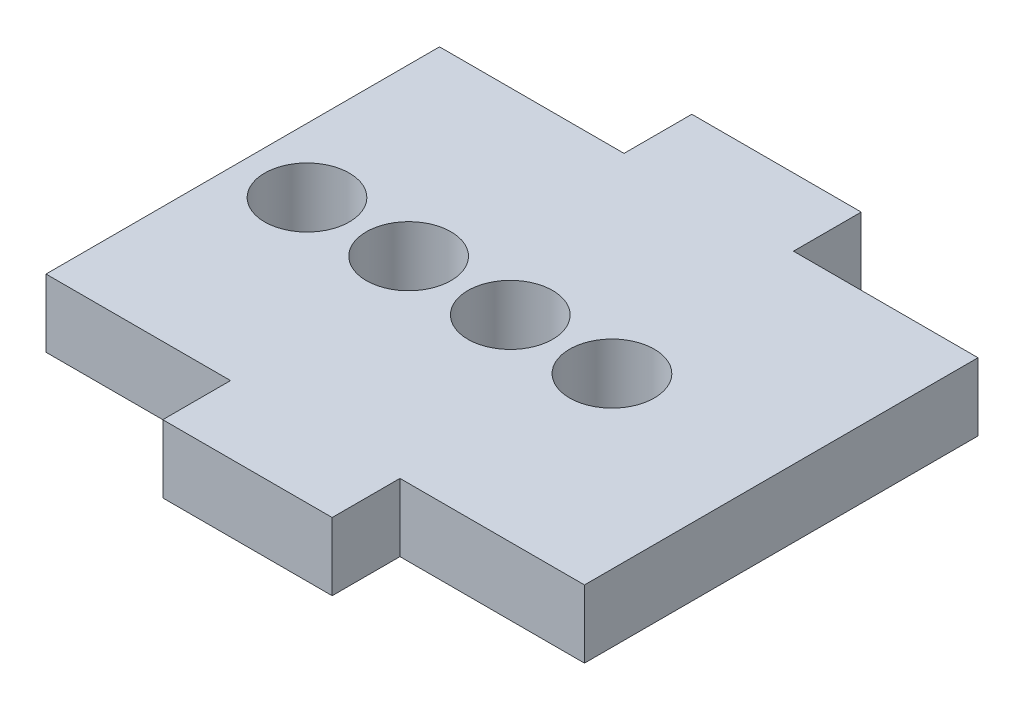
ISO-10303-21;
HEADER;
FILE_DESCRIPTION(('STEP AP214'),'2;1');
FILE_NAME('part.step','',(''),(''),'','','');
FILE_SCHEMA(('AUTOMOTIVE_DESIGN { 1 0 10303 214 1 1 1 1 }'));
ENDSEC;
DATA;
#1=APPLICATION_CONTEXT('core data for automotive mechanical design processes');
#2=APPLICATION_PROTOCOL_DEFINITION('international standard','automotive_design',2000,#1);
#3=PRODUCT_CONTEXT('',#1,'mechanical');
#4=PRODUCT('Part','Part','',(#3));
#5=PRODUCT_RELATED_PRODUCT_CATEGORY('part','',(#4));
#6=PRODUCT_DEFINITION_FORMATION('','',#4);
#7=PRODUCT_DEFINITION_CONTEXT('part definition',#1,'design');
#8=PRODUCT_DEFINITION('design','',#6,#7);
#9=PRODUCT_DEFINITION_SHAPE('','',#8);
#10=(LENGTH_UNIT() NAMED_UNIT(*) SI_UNIT(.MILLI.,.METRE.));
#11=(NAMED_UNIT(*) PLANE_ANGLE_UNIT() SI_UNIT($,.RADIAN.));
#12=(NAMED_UNIT(*) SI_UNIT($,.STERADIAN.) SOLID_ANGLE_UNIT());
#13=UNCERTAINTY_MEASURE_WITH_UNIT(LENGTH_MEASURE(1.E-05),#10,'distance_accuracy_value','');
#14=(GEOMETRIC_REPRESENTATION_CONTEXT(3) GLOBAL_UNCERTAINTY_ASSIGNED_CONTEXT((#13)) GLOBAL_UNIT_ASSIGNED_CONTEXT((#10,
#11,#12)) REPRESENTATION_CONTEXT('',''));
#15=CARTESIAN_POINT('',(0.,0.,0.));
#16=DIRECTION('',(0.,0.,1.));
#17=DIRECTION('',(1.,0.,0.));
#18=AXIS2_PLACEMENT_3D('',#15,#16,#17);
#19=CARTESIAN_POINT('',(27.518556454203,4.,-11.6138310832215));
#20=DIRECTION('',(0.,0.,1.));
#21=DIRECTION('',(1.,0.,0.));
#22=AXIS2_PLACEMENT_3D('',#19,#20,#21);
#23=PLANE('',#22);
#24=DIRECTION('',(0.,1.,0.));
#25=VECTOR('',#24,1.);
#26=CARTESIAN_POINT('',(23.600343903753,0.,-11.6138310832215));
#27=LINE('',#26,#25);
#28=CARTESIAN_POINT('',(23.600343903753,0.,-11.6138310832215));
#29=VERTEX_POINT('',#28);
#30=CARTESIAN_POINT('',(23.600343903753,4.,-11.6138310832215));
#31=VERTEX_POINT('',#30);
#32=EDGE_CURVE('E58',#29,#31,#27,.T.);
#33=ORIENTED_EDGE('',*,*,#32,.F.);
#34=DIRECTION('',(-1.,0.,0.));
#35=VECTOR('',#34,1.);
#36=CARTESIAN_POINT('',(27.518556454203,0.,-11.6138310832215));
#37=LINE('',#36,#35);
#38=CARTESIAN_POINT('',(12.7081857398498,0.,-11.6138310832215));
#39=VERTEX_POINT('',#38);
#40=EDGE_CURVE('E227',#29,#39,#37,.T.);
#41=ORIENTED_EDGE('',*,*,#40,.T.);
#42=DIRECTION('',(0.,-1.,0.));
#43=VECTOR('',#42,1.);
#44=CARTESIAN_POINT('',(12.7081857398498,4.,-11.6138310832215));
#45=LINE('',#44,#43);
#46=CARTESIAN_POINT('',(12.7081857398498,4.,-11.6138310832215));
#47=VERTEX_POINT('',#46);
#48=EDGE_CURVE('E43',#47,#39,#45,.T.);
#49=ORIENTED_EDGE('',*,*,#48,.F.);
#50=DIRECTION('',(-1.,0.,0.));
#51=VECTOR('',#50,1.);
#52=CARTESIAN_POINT('',(36.7868777555258,4.,-11.6138310832215));
#53=LINE('',#52,#51);
#54=EDGE_CURVE('E214',#31,#47,#53,.T.);
#55=ORIENTED_EDGE('',*,*,#54,.F.);
#56=EDGE_LOOP('',(#33,#41,#49,#55));
#57=FACE_BOUND('',#56,.T.);
#58=ADVANCED_FACE('F35',(#57),#23,.F.);
#59=CARTESIAN_POINT('',(36.7868777555258,4.,11.6138310832215));
#60=DIRECTION('',(0.,0.,-1.));
#61=DIRECTION('',(-1.,0.,0.));
#62=AXIS2_PLACEMENT_3D('',#59,#60,#61);
#63=PLANE('',#62);
#64=DIRECTION('',(0.,1.,0.));
#65=VECTOR('',#64,1.);
#66=CARTESIAN_POINT('',(33.600343903753,0.,11.6138310832215));
#67=LINE('',#66,#65);
#68=CARTESIAN_POINT('',(33.600343903753,0.,11.6138310832215));
#69=VERTEX_POINT('',#68);
#70=CARTESIAN_POINT('',(33.600343903753,4.,11.6138310832215));
#71=VERTEX_POINT('',#70);
#72=EDGE_CURVE('E155',#69,#71,#67,.T.);
#73=ORIENTED_EDGE('',*,*,#72,.F.);
#74=DIRECTION('',(1.,0.,0.));
#75=VECTOR('',#74,1.);
#76=CARTESIAN_POINT('',(36.7868777555258,0.,11.6138310832215));
#77=LINE('',#76,#75);
#78=CARTESIAN_POINT('',(44.4925020676562,0.,11.6138310832215));
#79=VERTEX_POINT('',#78);
#80=EDGE_CURVE('E233',#69,#79,#77,.T.);
#81=ORIENTED_EDGE('',*,*,#80,.T.);
#82=DIRECTION('',(0.,-1.,0.));
#83=VECTOR('',#82,1.);
#84=CARTESIAN_POINT('',(44.4925020676562,4.,11.6138310832215));
#85=LINE('',#84,#83);
#86=CARTESIAN_POINT('',(44.4925020676562,4.,11.6138310832215));
#87=VERTEX_POINT('',#86);
#88=EDGE_CURVE('E224',#87,#79,#85,.T.);
#89=ORIENTED_EDGE('',*,*,#88,.F.);
#90=DIRECTION('',(1.,0.,0.));
#91=VECTOR('',#90,1.);
#92=CARTESIAN_POINT('',(27.518556454203,4.,11.6138310832215));
#93=LINE('',#92,#91);
#94=EDGE_CURVE('E220',#71,#87,#93,.T.);
#95=ORIENTED_EDGE('',*,*,#94,.F.);
#96=EDGE_LOOP('',(#73,#81,#89,#95));
#97=FACE_BOUND('',#96,.T.);
#98=ADVANCED_FACE('F285',(#97),#63,.F.);
#99=DIRECTION('',(0.,-1.,0.));
#100=VECTOR('',#99,1.);
#101=CARTESIAN_POINT('',(23.600343903753,0.,11.6138310832215));
#102=LINE('',#101,#100);
#103=CARTESIAN_POINT('',(23.600343903753,4.,11.6138310832215));
#104=VERTEX_POINT('',#103);
#105=CARTESIAN_POINT('',(23.600343903753,0.,11.6138310832215));
#106=VERTEX_POINT('',#105);
#107=EDGE_CURVE('E164',#104,#106,#102,.T.);
#108=ORIENTED_EDGE('',*,*,#107,.F.);
#109=CARTESIAN_POINT('',(12.7081857398498,4.,11.6138310832215));
#110=VERTEX_POINT('',#109);
#111=EDGE_CURVE('E221',#110,#104,#93,.T.);
#112=ORIENTED_EDGE('',*,*,#111,.F.);
#113=DIRECTION('',(0.,-1.,0.));
#114=VECTOR('',#113,1.);
#115=CARTESIAN_POINT('',(12.7081857398498,4.,11.6138310832215));
#116=LINE('',#115,#114);
#117=CARTESIAN_POINT('',(12.7081857398498,0.,11.6138310832215));
#118=VERTEX_POINT('',#117);
#119=EDGE_CURVE('E237',#110,#118,#116,.T.);
#120=ORIENTED_EDGE('',*,*,#119,.T.);
#121=EDGE_CURVE('E215',#118,#106,#77,.T.);
#122=ORIENTED_EDGE('',*,*,#121,.T.);
#123=EDGE_LOOP('',(#108,#112,#120,#122));
#124=FACE_BOUND('',#123,.T.);
#125=ADVANCED_FACE('F249',(#124),#63,.F.);
#126=CARTESIAN_POINT('',(0.,4.,0.));
#127=DIRECTION('',(0.,1.,0.));
#128=DIRECTION('',(0.,0.,1.));
#129=AXIS2_PLACEMENT_3D('',#126,#127,#128);
#130=PLANE('',#129);
#131=CARTESIAN_POINT('',(28.5,4.,0.));
#132=DIRECTION('',(0.,1.,0.));
#133=DIRECTION('',(0.,0.,1.));
#134=AXIS2_PLACEMENT_3D('',#131,#132,#133);
#135=CIRCLE('',#134,2.5);
#136=CARTESIAN_POINT('',(28.5,4.,2.5));
#137=VERTEX_POINT('',#136);
#138=EDGE_CURVE('E193',#137,#137,#135,.T.);
#139=ORIENTED_EDGE('',*,*,#138,.F.);
#140=EDGE_LOOP('',(#139));
#141=FACE_BOUND('',#140,.T.);
#142=CARTESIAN_POINT('',(16.5,4.,0.));
#143=DIRECTION('',(0.,1.,0.));
#144=DIRECTION('',(0.,0.,1.));
#145=AXIS2_PLACEMENT_3D('',#142,#143,#144);
#146=CIRCLE('',#145,2.5);
#147=CARTESIAN_POINT('',(16.5,4.,2.5));
#148=VERTEX_POINT('',#147);
#149=EDGE_CURVE('E205',#148,#148,#146,.T.);
#150=ORIENTED_EDGE('',*,*,#149,.F.);
#151=EDGE_LOOP('',(#150));
#152=FACE_BOUND('',#151,.T.);
#153=DIRECTION('',(0.,0.,-1.));
#154=VECTOR('',#153,1.);
#155=CARTESIAN_POINT('',(44.4925020676562,4.,-11.6138310832215));
#156=LINE('',#155,#154);
#157=CARTESIAN_POINT('',(44.4925020676562,4.,-11.6138310832215));
#158=VERTEX_POINT('',#157);
#159=EDGE_CURVE('E211',#87,#158,#156,.T.);
#160=ORIENTED_EDGE('',*,*,#159,.T.);
#161=CARTESIAN_POINT('',(33.600343903753,4.,-11.6138310832215));
#162=VERTEX_POINT('',#161);
#163=EDGE_CURVE('E216',#158,#162,#53,.T.);
#164=ORIENTED_EDGE('',*,*,#163,.T.);
#165=DIRECTION('',(0.,0.,1.));
#166=VECTOR('',#165,1.);
#167=CARTESIAN_POINT('',(33.600343903753,4.,-15.6138310832215));
#168=LINE('',#167,#166);
#169=CARTESIAN_POINT('',(33.600343903753,4.,-15.6138310832215));
#170=VERTEX_POINT('',#169);
#171=EDGE_CURVE('E131',#170,#162,#168,.T.);
#172=ORIENTED_EDGE('',*,*,#171,.F.);
#173=DIRECTION('',(1.,0.,0.));
#174=VECTOR('',#173,1.);
#175=CARTESIAN_POINT('',(23.600343903753,4.,-15.6138310832215));
#176=LINE('',#175,#174);
#177=CARTESIAN_POINT('',(23.600343903753,4.,-15.6138310832215));
#178=VERTEX_POINT('',#177);
#179=EDGE_CURVE('E139',#178,#170,#176,.T.);
#180=ORIENTED_EDGE('',*,*,#179,.F.);
#181=DIRECTION('',(0.,0.,1.));
#182=VECTOR('',#181,1.);
#183=CARTESIAN_POINT('',(23.600343903753,4.,-15.6138310832215));
#184=LINE('',#183,#182);
#185=EDGE_CURVE('E156',#178,#31,#184,.T.);
#186=ORIENTED_EDGE('',*,*,#185,.T.);
#187=ORIENTED_EDGE('',*,*,#54,.T.);
#188=DIRECTION('',(0.,0.,1.));
#189=VECTOR('',#188,1.);
#190=CARTESIAN_POINT('',(12.7081857398498,4.,-11.6138310832215));
#191=LINE('',#190,#189);
#192=EDGE_CURVE('E218',#47,#110,#191,.T.);
#193=ORIENTED_EDGE('',*,*,#192,.T.);
#194=ORIENTED_EDGE('',*,*,#111,.T.);
#195=DIRECTION('',(0.,0.,-1.));
#196=VECTOR('',#195,1.);
#197=CARTESIAN_POINT('',(23.600343903753,4.,15.6138310832215));
#198=LINE('',#197,#196);
#199=CARTESIAN_POINT('',(23.600343903753,4.,15.6138310832215));
#200=VERTEX_POINT('',#199);
#201=EDGE_CURVE('E180',#200,#104,#198,.T.);
#202=ORIENTED_EDGE('',*,*,#201,.F.);
#203=DIRECTION('',(-1.,0.,0.));
#204=VECTOR('',#203,1.);
#205=CARTESIAN_POINT('',(23.600343903753,4.,15.6138310832215));
#206=LINE('',#205,#204);
#207=CARTESIAN_POINT('',(33.600343903753,4.,15.6138310832215));
#208=VERTEX_POINT('',#207);
#209=EDGE_CURVE('E163',#208,#200,#206,.T.);
#210=ORIENTED_EDGE('',*,*,#209,.F.);
#211=DIRECTION('',(0.,0.,-1.));
#212=VECTOR('',#211,1.);
#213=CARTESIAN_POINT('',(33.600343903753,4.,15.6138310832215));
#214=LINE('',#213,#212);
#215=EDGE_CURVE('E183',#208,#71,#214,.T.);
#216=ORIENTED_EDGE('',*,*,#215,.T.);
#217=ORIENTED_EDGE('',*,*,#94,.T.);
#218=EDGE_LOOP('',(#160,#164,#172,#180,#186,#187,#193,#194,#202,#210,#216,#217));
#219=FACE_BOUND('',#218,.T.);
#220=CARTESIAN_POINT('',(22.5,4.,0.));
#221=DIRECTION('',(0.,1.,0.));
#222=DIRECTION('',(0.,0.,1.));
#223=AXIS2_PLACEMENT_3D('',#220,#221,#222);
#224=CIRCLE('',#223,2.5);
#225=CARTESIAN_POINT('',(22.5,4.,2.5));
#226=VERTEX_POINT('',#225);
#227=EDGE_CURVE('E199',#226,#226,#224,.T.);
#228=ORIENTED_EDGE('',*,*,#227,.F.);
#229=EDGE_LOOP('',(#228));
#230=FACE_BOUND('',#229,.T.);
#231=CARTESIAN_POINT('',(34.5,4.,0.));
#232=DIRECTION('',(0.,1.,0.));
#233=DIRECTION('',(0.,0.,1.));
#234=AXIS2_PLACEMENT_3D('',#231,#232,#233);
#235=CIRCLE('',#234,2.5);
#236=CARTESIAN_POINT('',(34.5,4.,2.5));
#237=VERTEX_POINT('',#236);
#238=EDGE_CURVE('E187',#237,#237,#235,.T.);
#239=ORIENTED_EDGE('',*,*,#238,.F.);
#240=EDGE_LOOP('',(#239));
#241=FACE_BOUND('',#240,.T.);
#242=ADVANCED_FACE('F256',(#141,#152,#219,#230,#241),#130,.T.);
#243=CARTESIAN_POINT('',(0.,0.,0.));
#244=DIRECTION('',(0.,1.,0.));
#245=DIRECTION('',(0.,0.,1.));
#246=AXIS2_PLACEMENT_3D('',#243,#244,#245);
#247=PLANE('',#246);
#248=DIRECTION('',(0.,0.,-1.));
#249=VECTOR('',#248,1.);
#250=CARTESIAN_POINT('',(44.4925020676562,0.,-11.6138310832215));
#251=LINE('',#250,#249);
#252=CARTESIAN_POINT('',(44.4925020676562,0.,-11.6138310832215));
#253=VERTEX_POINT('',#252);
#254=EDGE_CURVE('E208',#79,#253,#251,.T.);
#255=ORIENTED_EDGE('',*,*,#254,.F.);
#256=ORIENTED_EDGE('',*,*,#80,.F.);
#257=DIRECTION('',(0.,0.,-1.));
#258=VECTOR('',#257,1.);
#259=CARTESIAN_POINT('',(33.600343903753,0.,15.6138310832215));
#260=LINE('',#259,#258);
#261=CARTESIAN_POINT('',(33.600343903753,0.,15.6138310832215));
#262=VERTEX_POINT('',#261);
#263=EDGE_CURVE('E170',#262,#69,#260,.T.);
#264=ORIENTED_EDGE('',*,*,#263,.F.);
#265=DIRECTION('',(1.,0.,0.));
#266=VECTOR('',#265,1.);
#267=CARTESIAN_POINT('',(23.600343903753,0.,15.6138310832215));
#268=LINE('',#267,#266);
#269=CARTESIAN_POINT('',(23.600343903753,0.,15.6138310832215));
#270=VERTEX_POINT('',#269);
#271=EDGE_CURVE('E168',#270,#262,#268,.T.);
#272=ORIENTED_EDGE('',*,*,#271,.F.);
#273=DIRECTION('',(0.,0.,-1.));
#274=VECTOR('',#273,1.);
#275=CARTESIAN_POINT('',(23.600343903753,0.,15.6138310832215));
#276=LINE('',#275,#274);
#277=EDGE_CURVE('E177',#270,#106,#276,.T.);
#278=ORIENTED_EDGE('',*,*,#277,.T.);
#279=ORIENTED_EDGE('',*,*,#121,.F.);
#280=DIRECTION('',(0.,0.,1.));
#281=VECTOR('',#280,1.);
#282=CARTESIAN_POINT('',(12.7081857398498,0.,-11.6138310832215));
#283=LINE('',#282,#281);
#284=EDGE_CURVE('E230',#39,#118,#283,.T.);
#285=ORIENTED_EDGE('',*,*,#284,.F.);
#286=ORIENTED_EDGE('',*,*,#40,.F.);
#287=DIRECTION('',(0.,0.,1.));
#288=VECTOR('',#287,1.);
#289=CARTESIAN_POINT('',(23.600343903753,0.,-15.6138310832215));
#290=LINE('',#289,#288);
#291=CARTESIAN_POINT('',(23.600343903753,0.,-15.6138310832215));
#292=VERTEX_POINT('',#291);
#293=EDGE_CURVE('E146',#292,#29,#290,.T.);
#294=ORIENTED_EDGE('',*,*,#293,.F.);
#295=DIRECTION('',(1.,0.,0.));
#296=VECTOR('',#295,1.);
#297=CARTESIAN_POINT('',(23.600343903753,0.,-15.6138310832215));
#298=LINE('',#297,#296);
#299=CARTESIAN_POINT('',(33.600343903753,0.,-15.6138310832215));
#300=VERTEX_POINT('',#299);
#301=EDGE_CURVE('E137',#292,#300,#298,.T.);
#302=ORIENTED_EDGE('',*,*,#301,.T.);
#303=DIRECTION('',(0.,0.,1.));
#304=VECTOR('',#303,1.);
#305=CARTESIAN_POINT('',(33.600343903753,0.,-15.6138310832215));
#306=LINE('',#305,#304);
#307=CARTESIAN_POINT('',(33.600343903753,0.,-11.6138310832215));
#308=VERTEX_POINT('',#307);
#309=EDGE_CURVE('E124',#300,#308,#306,.T.);
#310=ORIENTED_EDGE('',*,*,#309,.T.);
#311=EDGE_CURVE('E228',#253,#308,#37,.T.);
#312=ORIENTED_EDGE('',*,*,#311,.F.);
#313=EDGE_LOOP('',(#255,#256,#264,#272,#278,#279,#285,#286,#294,#302,#310,#312));
#314=FACE_BOUND('',#313,.T.);
#315=CARTESIAN_POINT('',(16.5,0.,0.));
#316=DIRECTION('',(0.,1.,0.));
#317=DIRECTION('',(0.,0.,1.));
#318=AXIS2_PLACEMENT_3D('',#315,#316,#317);
#319=CIRCLE('',#318,2.5);
#320=CARTESIAN_POINT('',(16.5,0.,2.5));
#321=VERTEX_POINT('',#320);
#322=EDGE_CURVE('E202',#321,#321,#319,.T.);
#323=ORIENTED_EDGE('',*,*,#322,.T.);
#324=EDGE_LOOP('',(#323));
#325=FACE_BOUND('',#324,.T.);
#326=CARTESIAN_POINT('',(22.5,0.,0.));
#327=DIRECTION('',(0.,1.,0.));
#328=DIRECTION('',(0.,0.,1.));
#329=AXIS2_PLACEMENT_3D('',#326,#327,#328);
#330=CIRCLE('',#329,2.5);
#331=CARTESIAN_POINT('',(22.5,0.,2.5));
#332=VERTEX_POINT('',#331);
#333=EDGE_CURVE('E196',#332,#332,#330,.T.);
#334=ORIENTED_EDGE('',*,*,#333,.T.);
#335=EDGE_LOOP('',(#334));
#336=FACE_BOUND('',#335,.T.);
#337=CARTESIAN_POINT('',(28.5,0.,0.));
#338=DIRECTION('',(0.,1.,0.));
#339=DIRECTION('',(0.,0.,1.));
#340=AXIS2_PLACEMENT_3D('',#337,#338,#339);
#341=CIRCLE('',#340,2.5);
#342=CARTESIAN_POINT('',(28.5,0.,2.5));
#343=VERTEX_POINT('',#342);
#344=EDGE_CURVE('E190',#343,#343,#341,.T.);
#345=ORIENTED_EDGE('',*,*,#344,.T.);
#346=EDGE_LOOP('',(#345));
#347=FACE_BOUND('',#346,.T.);
#348=CARTESIAN_POINT('',(34.5,0.,0.));
#349=DIRECTION('',(0.,1.,0.));
#350=DIRECTION('',(0.,0.,1.));
#351=AXIS2_PLACEMENT_3D('',#348,#349,#350);
#352=CIRCLE('',#351,2.5);
#353=CARTESIAN_POINT('',(34.5,0.,2.5));
#354=VERTEX_POINT('',#353);
#355=EDGE_CURVE('E186',#354,#354,#352,.T.);
#356=ORIENTED_EDGE('',*,*,#355,.T.);
#357=EDGE_LOOP('',(#356));
#358=FACE_BOUND('',#357,.T.);
#359=ADVANCED_FACE('F143',(#314,#325,#336,#347,#358),#247,.F.);
#360=CARTESIAN_POINT('',(44.4925020676562,4.,-11.6138310832215));
#361=DIRECTION('',(-1.,0.,0.));
#362=DIRECTION('',(0.,0.,1.));
#363=AXIS2_PLACEMENT_3D('',#360,#361,#362);
#364=PLANE('',#363);
#365=ORIENTED_EDGE('',*,*,#254,.T.);
#366=DIRECTION('',(0.,-1.,0.));
#367=VECTOR('',#366,1.);
#368=CARTESIAN_POINT('',(44.4925020676562,4.,-11.6138310832215));
#369=LINE('',#368,#367);
#370=EDGE_CURVE('E11',#158,#253,#369,.T.);
#371=ORIENTED_EDGE('',*,*,#370,.F.);
#372=ORIENTED_EDGE('',*,*,#159,.F.);
#373=ORIENTED_EDGE('',*,*,#88,.T.);
#374=EDGE_LOOP('',(#365,#371,#372,#373));
#375=FACE_BOUND('',#374,.T.);
#376=ADVANCED_FACE('F37',(#375),#364,.F.);
#377=ORIENTED_EDGE('',*,*,#311,.T.);
#378=DIRECTION('',(0.,1.,0.));
#379=VECTOR('',#378,1.);
#380=CARTESIAN_POINT('',(33.600343903753,0.,-11.6138310832215));
#381=LINE('',#380,#379);
#382=EDGE_CURVE('E50',#308,#162,#381,.T.);
#383=ORIENTED_EDGE('',*,*,#382,.T.);
#384=ORIENTED_EDGE('',*,*,#163,.F.);
#385=ORIENTED_EDGE('',*,*,#370,.T.);
#386=EDGE_LOOP('',(#377,#383,#384,#385));
#387=FACE_BOUND('',#386,.T.);
#388=ADVANCED_FACE('F263',(#387),#23,.F.);
#389=CARTESIAN_POINT('',(12.7081857398498,4.,-11.6138310832215));
#390=DIRECTION('',(1.,0.,0.));
#391=DIRECTION('',(0.,0.,-1.));
#392=AXIS2_PLACEMENT_3D('',#389,#390,#391);
#393=PLANE('',#392);
#394=ORIENTED_EDGE('',*,*,#284,.T.);
#395=ORIENTED_EDGE('',*,*,#119,.F.);
#396=ORIENTED_EDGE('',*,*,#192,.F.);
#397=ORIENTED_EDGE('',*,*,#48,.T.);
#398=EDGE_LOOP('',(#394,#395,#396,#397));
#399=FACE_BOUND('',#398,.T.);
#400=ADVANCED_FACE('F244',(#399),#393,.F.);
#401=CARTESIAN_POINT('',(16.5,4.,0.));
#402=DIRECTION('',(0.,-1.,0.));
#403=DIRECTION('',(0.,0.,-1.));
#404=AXIS2_PLACEMENT_3D('',#401,#402,#403);
#405=CYLINDRICAL_SURFACE('',#404,2.5);
#406=ORIENTED_EDGE('',*,*,#149,.T.);
#407=EDGE_LOOP('',(#406));
#408=FACE_BOUND('',#407,.T.);
#409=ORIENTED_EDGE('',*,*,#322,.F.);
#410=EDGE_LOOP('',(#409));
#411=FACE_BOUND('',#410,.T.);
#412=ADVANCED_FACE('F296',(#408,#411),#405,.F.);
#413=CARTESIAN_POINT('',(22.5,4.,0.));
#414=DIRECTION('',(0.,-1.,0.));
#415=DIRECTION('',(0.,0.,-1.));
#416=AXIS2_PLACEMENT_3D('',#413,#414,#415);
#417=CYLINDRICAL_SURFACE('',#416,2.5);
#418=ORIENTED_EDGE('',*,*,#227,.T.);
#419=EDGE_LOOP('',(#418));
#420=FACE_BOUND('',#419,.T.);
#421=ORIENTED_EDGE('',*,*,#333,.F.);
#422=EDGE_LOOP('',(#421));
#423=FACE_BOUND('',#422,.T.);
#424=ADVANCED_FACE('F309',(#420,#423),#417,.F.);
#425=CARTESIAN_POINT('',(28.5,4.,0.));
#426=DIRECTION('',(0.,-1.,0.));
#427=DIRECTION('',(0.,0.,-1.));
#428=AXIS2_PLACEMENT_3D('',#425,#426,#427);
#429=CYLINDRICAL_SURFACE('',#428,2.5);
#430=ORIENTED_EDGE('',*,*,#138,.T.);
#431=EDGE_LOOP('',(#430));
#432=FACE_BOUND('',#431,.T.);
#433=ORIENTED_EDGE('',*,*,#344,.F.);
#434=EDGE_LOOP('',(#433));
#435=FACE_BOUND('',#434,.T.);
#436=ADVANCED_FACE('F313',(#432,#435),#429,.F.);
#437=CARTESIAN_POINT('',(34.5,4.,0.));
#438=DIRECTION('',(0.,-1.,0.));
#439=DIRECTION('',(0.,0.,-1.));
#440=AXIS2_PLACEMENT_3D('',#437,#438,#439);
#441=CYLINDRICAL_SURFACE('',#440,2.5);
#442=ORIENTED_EDGE('',*,*,#238,.T.);
#443=EDGE_LOOP('',(#442));
#444=FACE_BOUND('',#443,.T.);
#445=ORIENTED_EDGE('',*,*,#355,.F.);
#446=EDGE_LOOP('',(#445));
#447=FACE_BOUND('',#446,.T.);
#448=ADVANCED_FACE('F317',(#444,#447),#441,.F.);
#449=CARTESIAN_POINT('',(33.600343903753,0.,15.6138310832215));
#450=DIRECTION('',(-1.,0.,0.));
#451=DIRECTION('',(0.,0.,1.));
#452=AXIS2_PLACEMENT_3D('',#449,#450,#451);
#453=PLANE('',#452);
#454=ORIENTED_EDGE('',*,*,#72,.T.);
#455=ORIENTED_EDGE('',*,*,#215,.F.);
#456=DIRECTION('',(0.,1.,0.));
#457=VECTOR('',#456,1.);
#458=CARTESIAN_POINT('',(33.600343903753,0.,15.6138310832215));
#459=LINE('',#458,#457);
#460=EDGE_CURVE('E160',#262,#208,#459,.T.);
#461=ORIENTED_EDGE('',*,*,#460,.F.);
#462=ORIENTED_EDGE('',*,*,#263,.T.);
#463=EDGE_LOOP('',(#454,#455,#461,#462));
#464=FACE_BOUND('',#463,.T.);
#465=ADVANCED_FACE('F271',(#464),#453,.F.);
#466=CARTESIAN_POINT('',(23.600343903753,0.,15.6138310832215));
#467=DIRECTION('',(1.,0.,0.));
#468=DIRECTION('',(0.,0.,-1.));
#469=AXIS2_PLACEMENT_3D('',#466,#467,#468);
#470=PLANE('',#469);
#471=ORIENTED_EDGE('',*,*,#107,.T.);
#472=ORIENTED_EDGE('',*,*,#277,.F.);
#473=DIRECTION('',(0.,-1.,0.));
#474=VECTOR('',#473,1.);
#475=CARTESIAN_POINT('',(23.600343903753,0.,15.6138310832215));
#476=LINE('',#475,#474);
#477=EDGE_CURVE('E166',#200,#270,#476,.T.);
#478=ORIENTED_EDGE('',*,*,#477,.F.);
#479=ORIENTED_EDGE('',*,*,#201,.T.);
#480=EDGE_LOOP('',(#471,#472,#478,#479));
#481=FACE_BOUND('',#480,.T.);
#482=ADVANCED_FACE('F252',(#481),#470,.F.);
#483=CARTESIAN_POINT('',(0.,0.,15.6138310832215));
#484=DIRECTION('',(0.,0.,-1.));
#485=DIRECTION('',(-1.,0.,0.));
#486=AXIS2_PLACEMENT_3D('',#483,#484,#485);
#487=PLANE('',#486);
#488=ORIENTED_EDGE('',*,*,#460,.T.);
#489=ORIENTED_EDGE('',*,*,#209,.T.);
#490=ORIENTED_EDGE('',*,*,#477,.T.);
#491=ORIENTED_EDGE('',*,*,#271,.T.);
#492=EDGE_LOOP('',(#488,#489,#490,#491));
#493=FACE_BOUND('',#492,.T.);
#494=ADVANCED_FACE('F274',(#493),#487,.F.);
#495=CARTESIAN_POINT('',(23.600343903753,0.,-15.6138310832215));
#496=DIRECTION('',(1.,0.,0.));
#497=DIRECTION('',(0.,0.,-1.));
#498=AXIS2_PLACEMENT_3D('',#495,#496,#497);
#499=PLANE('',#498);
#500=ORIENTED_EDGE('',*,*,#32,.T.);
#501=ORIENTED_EDGE('',*,*,#185,.F.);
#502=DIRECTION('',(0.,1.,0.));
#503=VECTOR('',#502,1.);
#504=CARTESIAN_POINT('',(23.600343903753,0.,-15.6138310832215));
#505=LINE('',#504,#503);
#506=EDGE_CURVE('E132',#292,#178,#505,.T.);
#507=ORIENTED_EDGE('',*,*,#506,.F.);
#508=ORIENTED_EDGE('',*,*,#293,.T.);
#509=EDGE_LOOP('',(#500,#501,#507,#508));
#510=FACE_BOUND('',#509,.T.);
#511=ADVANCED_FACE('F260',(#510),#499,.F.);
#512=CARTESIAN_POINT('',(33.600343903753,0.,-15.6138310832215));
#513=DIRECTION('',(1.,0.,0.));
#514=DIRECTION('',(0.,0.,-1.));
#515=AXIS2_PLACEMENT_3D('',#512,#513,#514);
#516=PLANE('',#515);
#517=ORIENTED_EDGE('',*,*,#382,.F.);
#518=ORIENTED_EDGE('',*,*,#309,.F.);
#519=DIRECTION('',(0.,1.,0.));
#520=VECTOR('',#519,1.);
#521=CARTESIAN_POINT('',(33.600343903753,0.,-15.6138310832215));
#522=LINE('',#521,#520);
#523=EDGE_CURVE('E128',#300,#170,#522,.T.);
#524=ORIENTED_EDGE('',*,*,#523,.T.);
#525=ORIENTED_EDGE('',*,*,#171,.T.);
#526=EDGE_LOOP('',(#517,#518,#524,#525));
#527=FACE_BOUND('',#526,.T.);
#528=ADVANCED_FACE('F126',(#527),#516,.T.);
#529=CARTESIAN_POINT('',(0.,0.,-15.6138310832215));
#530=DIRECTION('',(0.,0.,1.));
#531=DIRECTION('',(1.,0.,0.));
#532=AXIS2_PLACEMENT_3D('',#529,#530,#531);
#533=PLANE('',#532);
#534=ORIENTED_EDGE('',*,*,#301,.F.);
#535=ORIENTED_EDGE('',*,*,#506,.T.);
#536=ORIENTED_EDGE('',*,*,#179,.T.);
#537=ORIENTED_EDGE('',*,*,#523,.F.);
#538=EDGE_LOOP('',(#534,#535,#536,#537));
#539=FACE_BOUND('',#538,.T.);
#540=ADVANCED_FACE('F136',(#539),#533,.F.);
#541=CLOSED_SHELL('',(#58,#98,#125,#242,#359,#376,#388,#400,#412,#424,#436,#448,#465,#482,#494,
#511,#528,#540));
#542=MANIFOLD_SOLID_BREP('B2',#541);
#543=ADVANCED_BREP_SHAPE_REPRESENTATION('',(#18,#542),#14);
#544=SHAPE_DEFINITION_REPRESENTATION(#9,#543);
ENDSEC;
END-ISO-10303-21;
